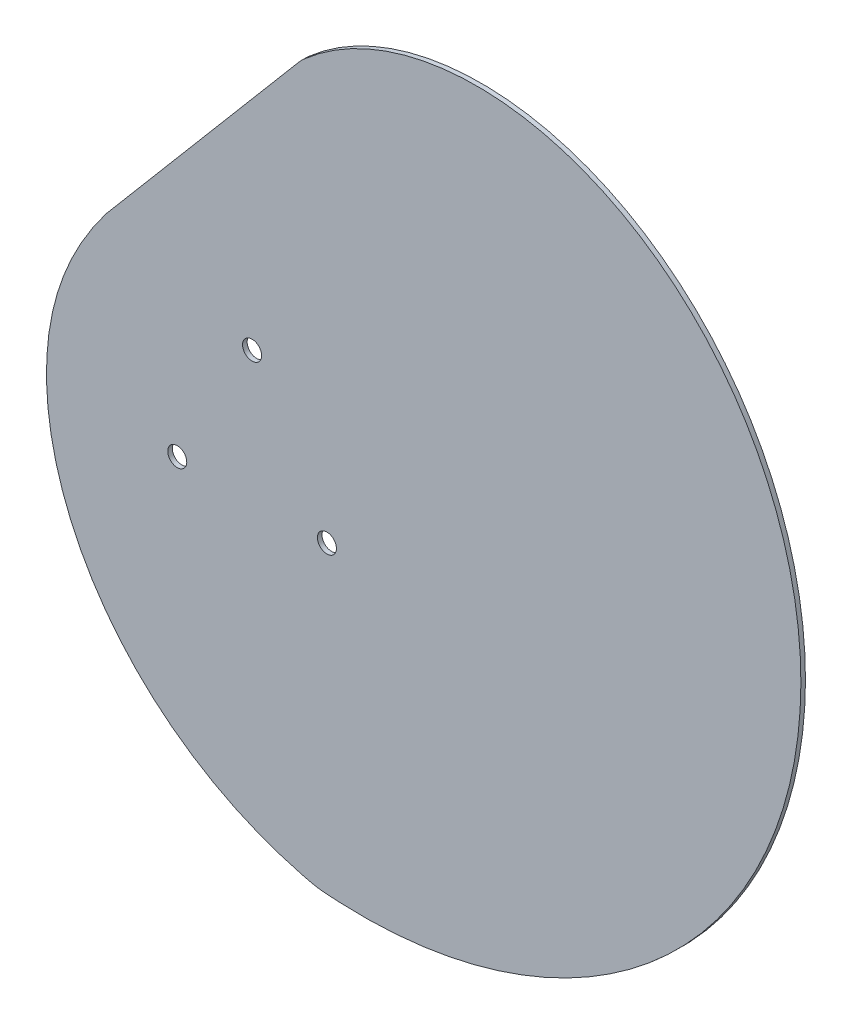
ISO-10303-21;
HEADER;
FILE_DESCRIPTION(('STEP AP214'),'2;1');
FILE_NAME('part.step','',(''),(''),'','','');
FILE_SCHEMA(('AUTOMOTIVE_DESIGN { 1 0 10303 214 1 1 1 1 }'));
ENDSEC;
DATA;
#1=APPLICATION_CONTEXT('core data for automotive mechanical design processes');
#2=APPLICATION_PROTOCOL_DEFINITION('international standard','automotive_design',2000,#1);
#3=PRODUCT_CONTEXT('',#1,'mechanical');
#4=PRODUCT('Part','Part','',(#3));
#5=PRODUCT_RELATED_PRODUCT_CATEGORY('part','',(#4));
#6=PRODUCT_DEFINITION_FORMATION('','',#4);
#7=PRODUCT_DEFINITION_CONTEXT('part definition',#1,'design');
#8=PRODUCT_DEFINITION('design','',#6,#7);
#9=PRODUCT_DEFINITION_SHAPE('','',#8);
#10=(LENGTH_UNIT() NAMED_UNIT(*) SI_UNIT(.MILLI.,.METRE.));
#11=(NAMED_UNIT(*) PLANE_ANGLE_UNIT() SI_UNIT($,.RADIAN.));
#12=(NAMED_UNIT(*) SI_UNIT($,.STERADIAN.) SOLID_ANGLE_UNIT());
#13=UNCERTAINTY_MEASURE_WITH_UNIT(LENGTH_MEASURE(1.E-05),#10,'distance_accuracy_value','');
#14=(GEOMETRIC_REPRESENTATION_CONTEXT(3) GLOBAL_UNCERTAINTY_ASSIGNED_CONTEXT((#13)) GLOBAL_UNIT_ASSIGNED_CONTEXT((#10,
#11,#12)) REPRESENTATION_CONTEXT('',''));
#15=CARTESIAN_POINT('',(0.,0.,0.));
#16=DIRECTION('',(0.,0.,1.));
#17=DIRECTION('',(1.,0.,0.));
#18=AXIS2_PLACEMENT_3D('',#15,#16,#17);
#19=CARTESIAN_POINT('',(-1.26128431869605,-76.3889966640853,-0.396875));
#20=CARTESIAN_POINT('',(-0.976706935574322,-76.433000958118,-0.396875));
#21=CARTESIAN_POINT('',(-0.40570033732491,-76.5002886734785,-0.396875));
#22=CARTESIAN_POINT('',(0.205282970299483,-76.5431286550552,-0.396875));
#23=CARTESIAN_POINT('',(0.635947632892369,-76.5659234882829,-0.396875));
#24=CARTESIAN_POINT('',(0.943803395898629,-76.5837536992732,-0.396875));
#25=CARTESIAN_POINT('',(1.51657766798327,-76.6253526449032,-0.396875));
#26=CARTESIAN_POINT('',(2.39472861708088,-76.6794226518138,-0.396875));
#27=CARTESIAN_POINT('',(3.1808192769605,-76.7137003743502,-0.396875));
#28=CARTESIAN_POINT('',(4.19803699961454,-76.75168724619,-0.396875));
#29=CARTESIAN_POINT('',(6.0521406389918,-76.7942720929503,-0.396875));
#30=CARTESIAN_POINT('',(8.65531896727179,-76.7757899651055,-0.396875));
#31=CARTESIAN_POINT('',(11.7992302850273,-76.631186753929,-0.396875));
#32=CARTESIAN_POINT('',(14.9308116076091,-76.362150817123,-0.396875));
#33=CARTESIAN_POINT('',(19.0927292822368,-75.8376989684194,-0.396875));
#34=CARTESIAN_POINT('',(24.2526003043896,-74.8709042385839,-0.396875));
#35=CARTESIAN_POINT('',(30.3366917936986,-73.2151665179252,-0.396875));
#36=CARTESIAN_POINT('',(38.2496377184228,-70.3553029330726,-0.396875));
#37=CARTESIAN_POINT('',(47.6646576679233,-65.5807106727296,-0.396875));
#38=CARTESIAN_POINT('',(57.8782405742599,-58.0526588499173,-0.396875));
#39=CARTESIAN_POINT('',(69.6472472290832,-45.8604490127679,-0.396875));
#40=CARTESIAN_POINT('',(80.1730162895738,-27.1334514768673,-0.396875));
#41=CARTESIAN_POINT('',(84.2538630410436,-1.50479165459522,-0.396875));
#42=CARTESIAN_POINT('',(79.5599947434369,19.8412067482863,-0.396875));
#43=CARTESIAN_POINT('',(70.8796865135484,34.9401638956233,-0.396875));
#44=CARTESIAN_POINT('',(62.021642873432,44.7053655266334,-0.396875));
#45=CARTESIAN_POINT('',(51.0907411074019,52.2640812116842,-0.396875));
#46=CARTESIAN_POINT('',(38.576471746608,57.0540859282341,-0.396875));
#47=CARTESIAN_POINT('',(25.1004774931715,58.5603822983813,-0.396875));
#48=CARTESIAN_POINT('',(13.7708368946147,56.6943293928139,-0.396875));
#49=CARTESIAN_POINT('',(5.22574400857566,53.179291685644,-0.396875));
#50=CARTESIAN_POINT('',(-0.75748548654271,49.5274645181489,-0.396875));
#51=CARTESIAN_POINT('',(-5.17982564226412,45.6481332259453,-0.396875));
#52=CARTESIAN_POINT('',(-8.21712868273601,42.3111233056651,-0.396875));
#53=CARTESIAN_POINT('',(-10.2837476793927,39.7285564460287,-0.396875));
#54=CARTESIAN_POINT('',(-12.1453981413637,37.1299230221057,-0.396875));
#55=CARTESIAN_POINT('',(-13.803593656072,34.6302202411006,-0.396875));
#56=CARTESIAN_POINT('',(-15.0263666385234,32.7872172676154,-0.396875));
#57=CARTESIAN_POINT('',(-15.757749026262,31.8150435741405,-0.396875));
#58=CARTESIAN_POINT('',(-16.4572837085939,31.0087975471452,-0.396875));
#59=CARTESIAN_POINT('',(-17.3148530430872,30.2124256121384,-0.396875));
#60=CARTESIAN_POINT('',(-18.8320987171928,29.1405411562789,-0.396875));
#61=CARTESIAN_POINT('',(-20.5794335453912,27.9210149954297,-0.396875));
#62=CARTESIAN_POINT('',(-21.8514483213816,26.9528121584477,-0.396875));
#63=CARTESIAN_POINT('',(-22.9229134864311,26.0255763335065,-0.396875));
#64=CARTESIAN_POINT('',(-23.9113330049711,25.0957745743073,-0.396875));
#65=CARTESIAN_POINT('',(-25.0438847891512,23.9057178105531,-0.396875));
#66=CARTESIAN_POINT('',(-26.2444451597005,22.4769501418682,-0.396875));
#67=CARTESIAN_POINT('',(-27.6678771544237,20.6032078316902,-0.396875));
#68=CARTESIAN_POINT('',(-29.1662720153948,18.3817060593167,-0.396875));
#69=CARTESIAN_POINT('',(-30.6820035254275,16.0304898055358,-0.396875));
#70=CARTESIAN_POINT('',(-31.8417450158577,14.3234191557175,-0.396875));
#71=CARTESIAN_POINT('',(-32.7929265221825,13.0258719381619,-0.396875));
#72=CARTESIAN_POINT('',(-33.7609917005133,11.7717771176703,-0.396875));
#73=CARTESIAN_POINT('',(-35.1935179417244,10.0318274989824,-0.396875));
#74=CARTESIAN_POINT('',(-37.0947743542895,7.68858611063458,-0.396875));
#75=CARTESIAN_POINT('',(-39.6505131759334,4.30610185058949,-0.396875));
#76=CARTESIAN_POINT('',(-42.6514237523282,-0.366044153239744,-0.396875));
#77=CARTESIAN_POINT('',(-45.5355557594005,-6.54725137287064,-0.396875));
#78=CARTESIAN_POINT('',(-47.5029702487626,-13.2116577754802,-0.396875));
#79=CARTESIAN_POINT('',(-48.6844974640878,-22.3699096817478,-0.396875));
#80=CARTESIAN_POINT('',(-47.6098868039418,-33.7322087237693,-0.396875));
#81=CARTESIAN_POINT('',(-42.8642408139455,-46.3451326435725,-0.396875));
#82=CARTESIAN_POINT('',(-36.5641298213063,-55.4680273522898,-0.396875));
#83=CARTESIAN_POINT('',(-30.4296575788591,-61.7275262732319,-0.396875));
#84=CARTESIAN_POINT('',(-25.3568115028753,-65.8672301951248,-0.396875));
#85=CARTESIAN_POINT('',(-20.7978951820845,-68.8298585097831,-0.396875));
#86=CARTESIAN_POINT('',(-16.9868888228126,-70.8972783811654,-0.396875));
#87=CARTESIAN_POINT('',(-14.0571261532245,-72.2940624730244,-0.396875));
#88=CARTESIAN_POINT('',(-11.0574897827893,-73.537247470639,-0.396875));
#89=CARTESIAN_POINT('',(-8.52863978148638,-74.4382486629739,-0.396875));
#90=CARTESIAN_POINT('',(-6.7053553577977,-75.0088395123344,-0.396875));
#91=CARTESIAN_POINT('',(-5.69991861950379,-75.3033007427362,-0.396875));
#92=CARTESIAN_POINT('',(-4.91466346108121,-75.5253296610727,-0.396875));
#93=CARTESIAN_POINT('',(-4.04372816904597,-75.7517503026063,-0.396875));
#94=CARTESIAN_POINT('',(-3.47701846483031,-75.8911528901832,-0.396875));
#95=CARTESIAN_POINT('',(-3.15620305968882,-75.9746877031505,-0.396875));
#96=CARTESIAN_POINT('',(-2.71872815087296,-76.0895979552755,-0.396875));
#97=CARTESIAN_POINT('',(-2.11316463605528,-76.2362629092826,-0.396875));
#98=CARTESIAN_POINT('',(-1.54586170181775,-76.3449923700527,-0.396875));
#99=CARTESIAN_POINT('',(-1.26128431869605,-76.3889966640853,-0.396875));
#100=B_SPLINE_CURVE_WITH_KNOTS('',3,(#19,#20,#21,#22,#23,#24,#25,#26,#27,#28,#29,#30,#31,#32,
#33,#34,#35,#36,#37,#38,#39,#40,#41,#42,#43,#44,#45,#46,#47,#48,#49,#50,#51,#52,#53,#54,#55,#56,
#57,#58,#59,#60,#61,#62,#63,#64,#65,#66,#67,#68,#69,#70,#71,#72,#73,#74,#75,#76,#77,#78,#79,#80,
#81,#82,#83,#84,#85,#86,#87,#88,#89,#90,#91,#92,#93,#94,#95,#96,#97,#98,#99),.UNSPECIFIED.,.T.,
.F.,(4,1,1,1,1,1,1,1,1,1,1,1,1,1,1,1,1,1,1,1,1,1,1,1,1,1,1,1,1,1,1,1,1,1,1,1,1,1,1,1,1,1,1,1,1,
1,1,1,1,1,1,1,1,1,1,1,1,1,1,1,1,1,1,1,1,1,1,1,1,1,1,1,1,1,1,1,1,1,4),(0.,0.0009765625,
0.001953125,0.0029296875,0.00390625,0.005859375,0.0078125,0.009765625,0.01171875,0.015625,
0.0234375,0.03125,0.0390625,0.046875,0.0625,0.078125,0.09375,0.125,0.15625,0.1875,0.25,0.3125,
0.375,0.40625,0.4375,0.46875,0.5,0.53125,0.5625,0.578125,0.59375,0.609375,0.6171875,0.625,
0.6328125,0.640625,0.6484375,0.65234375,0.65625,0.6640625,0.671875,0.67578125,0.6796875,
0.681640625,0.68359375,0.6875,0.69140625,0.6953125,0.703125,0.7109375,0.71875,0.72265625,
0.7265625,0.734375,0.7421875,0.75,0.765625,0.78125,0.796875,0.8125,0.84375,0.875,0.90625,
0.921875,0.9375,0.953125,0.9609375,0.96875,0.9765625,0.984375,0.98828125,0.990234375,0.9921875,
0.994140625,0.99609375,0.9970703125,0.998046875,0.9990234375,1.),.UNSPECIFIED.);
#101=DIRECTION('',(0.,0.,1.));
#102=VECTOR('',#101,1.);
#103=SURFACE_OF_LINEAR_EXTRUSION('',#100,#102);
#104=CARTESIAN_POINT('',(-1.26128431869605,-76.3889966640853,0.396875));
#105=CARTESIAN_POINT('',(-0.976706935574322,-76.433000958118,0.396875));
#106=CARTESIAN_POINT('',(-0.40570033732491,-76.5002886734785,0.396875));
#107=CARTESIAN_POINT('',(0.205282970299483,-76.5431286550552,0.396875));
#108=CARTESIAN_POINT('',(0.635947632892369,-76.5659234882829,0.396875));
#109=CARTESIAN_POINT('',(0.943803395898629,-76.5837536992732,0.396875));
#110=CARTESIAN_POINT('',(1.51657766798327,-76.6253526449032,0.396875));
#111=CARTESIAN_POINT('',(2.39472861708088,-76.6794226518138,0.396875));
#112=CARTESIAN_POINT('',(3.1808192769605,-76.7137003743502,0.396875));
#113=CARTESIAN_POINT('',(4.19803699961454,-76.75168724619,0.396875));
#114=CARTESIAN_POINT('',(6.0521406389918,-76.7942720929503,0.396875));
#115=CARTESIAN_POINT('',(8.65531896727179,-76.7757899651055,0.396875));
#116=CARTESIAN_POINT('',(11.7992302850273,-76.631186753929,0.396875));
#117=CARTESIAN_POINT('',(14.9308116076091,-76.362150817123,0.396875));
#118=CARTESIAN_POINT('',(19.0927292822368,-75.8376989684194,0.396875));
#119=CARTESIAN_POINT('',(24.2526003043896,-74.8709042385839,0.396875));
#120=CARTESIAN_POINT('',(30.3366917936986,-73.2151665179252,0.396875));
#121=CARTESIAN_POINT('',(38.2496377184228,-70.3553029330726,0.396875));
#122=CARTESIAN_POINT('',(47.6646576679233,-65.5807106727296,0.396875));
#123=CARTESIAN_POINT('',(57.8782405742599,-58.0526588499173,0.396875));
#124=CARTESIAN_POINT('',(69.6472472290832,-45.8604490127679,0.396875));
#125=CARTESIAN_POINT('',(80.1730162895738,-27.1334514768673,0.396875));
#126=CARTESIAN_POINT('',(84.2538630410436,-1.50479165459522,0.396875));
#127=CARTESIAN_POINT('',(79.5599947434369,19.8412067482863,0.396875));
#128=CARTESIAN_POINT('',(70.8796865135484,34.9401638956233,0.396875));
#129=CARTESIAN_POINT('',(62.021642873432,44.7053655266334,0.396875));
#130=CARTESIAN_POINT('',(51.0907411074019,52.2640812116842,0.396875));
#131=CARTESIAN_POINT('',(38.576471746608,57.0540859282341,0.396875));
#132=CARTESIAN_POINT('',(25.1004774931715,58.5603822983813,0.396875));
#133=CARTESIAN_POINT('',(13.7708368946147,56.6943293928139,0.396875));
#134=CARTESIAN_POINT('',(5.22574400857566,53.179291685644,0.396875));
#135=CARTESIAN_POINT('',(-0.75748548654271,49.5274645181489,0.396875));
#136=CARTESIAN_POINT('',(-5.17982564226412,45.6481332259453,0.396875));
#137=CARTESIAN_POINT('',(-8.21712868273601,42.3111233056651,0.396875));
#138=CARTESIAN_POINT('',(-10.2837476793927,39.7285564460287,0.396875));
#139=CARTESIAN_POINT('',(-12.1453981413637,37.1299230221057,0.396875));
#140=CARTESIAN_POINT('',(-13.803593656072,34.6302202411006,0.396875));
#141=CARTESIAN_POINT('',(-15.0263666385234,32.7872172676154,0.396875));
#142=CARTESIAN_POINT('',(-15.757749026262,31.8150435741405,0.396875));
#143=CARTESIAN_POINT('',(-16.4572837085939,31.0087975471452,0.396875));
#144=CARTESIAN_POINT('',(-17.3148530430872,30.2124256121384,0.396875));
#145=CARTESIAN_POINT('',(-18.8320987171928,29.1405411562789,0.396875));
#146=CARTESIAN_POINT('',(-20.5794335453912,27.9210149954297,0.396875));
#147=CARTESIAN_POINT('',(-21.8514483213816,26.9528121584477,0.396875));
#148=CARTESIAN_POINT('',(-22.9229134864311,26.0255763335065,0.396875));
#149=CARTESIAN_POINT('',(-23.9113330049711,25.0957745743073,0.396875));
#150=CARTESIAN_POINT('',(-25.0438847891512,23.9057178105531,0.396875));
#151=CARTESIAN_POINT('',(-26.2444451597005,22.4769501418682,0.396875));
#152=CARTESIAN_POINT('',(-27.6678771544237,20.6032078316902,0.396875));
#153=CARTESIAN_POINT('',(-29.1662720153948,18.3817060593167,0.396875));
#154=CARTESIAN_POINT('',(-30.6820035254275,16.0304898055358,0.396875));
#155=CARTESIAN_POINT('',(-31.8417450158577,14.3234191557175,0.396875));
#156=CARTESIAN_POINT('',(-32.7929265221825,13.0258719381619,0.396875));
#157=CARTESIAN_POINT('',(-33.7609917005133,11.7717771176703,0.396875));
#158=CARTESIAN_POINT('',(-35.1935179417244,10.0318274989824,0.396875));
#159=CARTESIAN_POINT('',(-37.0947743542895,7.68858611063458,0.396875));
#160=CARTESIAN_POINT('',(-39.6505131759334,4.30610185058949,0.396875));
#161=CARTESIAN_POINT('',(-42.6514237523282,-0.366044153239744,0.396875));
#162=CARTESIAN_POINT('',(-45.5355557594005,-6.54725137287064,0.396875));
#163=CARTESIAN_POINT('',(-47.5029702487626,-13.2116577754802,0.396875));
#164=CARTESIAN_POINT('',(-48.6844974640878,-22.3699096817478,0.396875));
#165=CARTESIAN_POINT('',(-47.6098868039418,-33.7322087237693,0.396875));
#166=CARTESIAN_POINT('',(-42.8642408139455,-46.3451326435725,0.396875));
#167=CARTESIAN_POINT('',(-36.5641298213063,-55.4680273522898,0.396875));
#168=CARTESIAN_POINT('',(-30.4296575788591,-61.7275262732319,0.396875));
#169=CARTESIAN_POINT('',(-25.3568115028753,-65.8672301951248,0.396875));
#170=CARTESIAN_POINT('',(-20.7978951820845,-68.8298585097831,0.396875));
#171=CARTESIAN_POINT('',(-16.9868888228126,-70.8972783811654,0.396875));
#172=CARTESIAN_POINT('',(-14.0571261532245,-72.2940624730244,0.396875));
#173=CARTESIAN_POINT('',(-11.0574897827893,-73.537247470639,0.396875));
#174=CARTESIAN_POINT('',(-8.52863978148638,-74.4382486629739,0.396875));
#175=CARTESIAN_POINT('',(-6.7053553577977,-75.0088395123344,0.396875));
#176=CARTESIAN_POINT('',(-5.69991861950379,-75.3033007427362,0.396875));
#177=CARTESIAN_POINT('',(-4.91466346108121,-75.5253296610727,0.396875));
#178=CARTESIAN_POINT('',(-4.04372816904597,-75.7517503026063,0.396875));
#179=CARTESIAN_POINT('',(-3.47701846483031,-75.8911528901832,0.396875));
#180=CARTESIAN_POINT('',(-3.15620305968882,-75.9746877031505,0.396875));
#181=CARTESIAN_POINT('',(-2.71872815087296,-76.0895979552755,0.396875));
#182=CARTESIAN_POINT('',(-2.11316463605528,-76.2362629092826,0.396875));
#183=CARTESIAN_POINT('',(-1.54586170181775,-76.3449923700527,0.396875));
#184=CARTESIAN_POINT('',(-1.26128431869605,-76.3889966640853,0.396875));
#185=B_SPLINE_CURVE_WITH_KNOTS('',3,(#104,#105,#106,#107,#108,#109,#110,#111,#112,#113,#114,
#115,#116,#117,#118,#119,#120,#121,#122,#123,#124,#125,#126,#127,#128,#129,#130,#131,#132,#133,
#134,#135,#136,#137,#138,#139,#140,#141,#142,#143,#144,#145,#146,#147,#148,#149,#150,#151,#152,
#153,#154,#155,#156,#157,#158,#159,#160,#161,#162,#163,#164,#165,#166,#167,#168,#169,#170,#171,
#172,#173,#174,#175,#176,#177,#178,#179,#180,#181,#182,#183,#184),.UNSPECIFIED.,.T.,.F.,(4,1,1,
1,1,1,1,1,1,1,1,1,1,1,1,1,1,1,1,1,1,1,1,1,1,1,1,1,1,1,1,1,1,1,1,1,1,1,1,1,1,1,1,1,1,1,1,1,1,1,1,
1,1,1,1,1,1,1,1,1,1,1,1,1,1,1,1,1,1,1,1,1,1,1,1,1,1,1,4),(0.,0.0009765625,0.001953125,
0.0029296875,0.00390625,0.005859375,0.0078125,0.009765625,0.01171875,0.015625,0.0234375,0.03125,
0.0390625,0.046875,0.0625,0.078125,0.09375,0.125,0.15625,0.1875,0.25,0.3125,0.375,0.40625,
0.4375,0.46875,0.5,0.53125,0.5625,0.578125,0.59375,0.609375,0.6171875,0.625,0.6328125,0.640625,
0.6484375,0.65234375,0.65625,0.6640625,0.671875,0.67578125,0.6796875,0.681640625,0.68359375,
0.6875,0.69140625,0.6953125,0.703125,0.7109375,0.71875,0.72265625,0.7265625,0.734375,0.7421875,
0.75,0.765625,0.78125,0.796875,0.8125,0.84375,0.875,0.90625,0.921875,0.9375,0.953125,0.9609375,
0.96875,0.9765625,0.984375,0.98828125,0.990234375,0.9921875,0.994140625,0.99609375,0.9970703125,
0.998046875,0.9990234375,1.),.UNSPECIFIED.);
#186=CARTESIAN_POINT('',(-37.9799857120954,6.50792390325195,0.396875));
#187=VERTEX_POINT('',#186);
#188=CARTESIAN_POINT('',(-3.53695857470606,47.0282576025844,0.396875));
#189=VERTEX_POINT('',#188);
#190=EDGE_CURVE('E84',#187,#189,#185,.T.);
#191=ORIENTED_EDGE('',*,*,#190,.F.);
#192=DIRECTION('',(0.,0.,-1.));
#193=VECTOR('',#192,1.);
#194=CARTESIAN_POINT('',(-37.9799857120954,6.50792390325195,0.396875));
#195=LINE('',#194,#193);
#196=CARTESIAN_POINT('',(-37.9799857120954,6.50792390325195,-0.396875));
#197=VERTEX_POINT('',#196);
#198=EDGE_CURVE('E71',#187,#197,#195,.T.);
#199=ORIENTED_EDGE('',*,*,#198,.T.);
#200=CARTESIAN_POINT('',(-3.53695857470606,47.0282576025844,-0.396875));
#201=VERTEX_POINT('',#200);
#202=EDGE_CURVE('E77',#197,#201,#100,.T.);
#203=ORIENTED_EDGE('',*,*,#202,.T.);
#204=DIRECTION('',(0.,0.,1.));
#205=VECTOR('',#204,1.);
#206=CARTESIAN_POINT('',(-3.53695857470606,47.0282576025844,0.396875));
#207=LINE('',#206,#205);
#208=EDGE_CURVE('E147',#189,#201,#207,.F.);
#209=ORIENTED_EDGE('',*,*,#208,.F.);
#210=EDGE_LOOP('',(#191,#199,#203,#209));
#211=FACE_BOUND('',#210,.T.);
#212=ADVANCED_FACE('F37',(#211),#103,.T.);
#213=CARTESIAN_POINT('',(0.,0.,-0.396875));
#214=DIRECTION('',(0.,0.,-1.));
#215=DIRECTION('',(1.,0.,0.));
#216=AXIS2_PLACEMENT_3D('',#213,#214,#215);
#217=PLANE('',#216);
#218=CARTESIAN_POINT('',(-12.5939001772955,-1.27258597502269,-0.396875000000001));
#219=DIRECTION('',(0.,0.,1.));
#220=DIRECTION('',(1.,0.,0.));
#221=AXIS2_PLACEMENT_3D('',#218,#219,#220);
#222=CIRCLE('',#221,1.64999999999999);
#223=CARTESIAN_POINT('',(-10.9439001772955,-1.27258597502269,-0.396875000000001));
#224=VERTEX_POINT('',#223);
#225=EDGE_CURVE('E130',#224,#224,#222,.T.);
#226=ORIENTED_EDGE('',*,*,#225,.T.);
#227=EDGE_LOOP('',(#226));
#228=FACE_BOUND('',#227,.T.);
#229=CARTESIAN_POINT('',(0.396480879471766,-23.7725859750223,-0.396875000000001));
#230=DIRECTION('',(0.,0.,1.));
#231=DIRECTION('',(1.,0.,0.));
#232=AXIS2_PLACEMENT_3D('',#229,#230,#231);
#233=CIRCLE('',#232,1.64999999999999);
#234=CARTESIAN_POINT('',(2.04648087947175,-23.7725859750223,-0.396875000000001));
#235=VERTEX_POINT('',#234);
#236=EDGE_CURVE('E132',#235,#235,#233,.T.);
#237=ORIENTED_EDGE('',*,*,#236,.T.);
#238=EDGE_LOOP('',(#237));
#239=FACE_BOUND('',#238,.T.);
#240=CARTESIAN_POINT('',(-25.5842812340614,-23.7725859750231,-0.396875000000001));
#241=DIRECTION('',(0.,0.,1.));
#242=DIRECTION('',(1.,0.,0.));
#243=AXIS2_PLACEMENT_3D('',#240,#241,#242);
#244=CIRCLE('',#243,1.64999999999999);
#245=CARTESIAN_POINT('',(-23.9342812340614,-23.7725859750231,-0.396875000000001));
#246=VERTEX_POINT('',#245);
#247=EDGE_CURVE('E140',#246,#246,#244,.T.);
#248=ORIENTED_EDGE('',*,*,#247,.T.);
#249=EDGE_LOOP('',(#248));
#250=FACE_BOUND('',#249,.T.);
#251=ORIENTED_EDGE('',*,*,#202,.F.);
#252=DIRECTION('',(0.64611477291147,0.763240263760737,0.));
#253=VECTOR('',#252,1.);
#254=CARTESIAN_POINT('',(-4.11931026186588,46.506747556973,-0.396875));
#255=LINE('',#254,#253);
#256=CARTESIAN_POINT('',(-4.56394467477297,45.9815113283459,-0.396875));
#257=VERTEX_POINT('',#256);
#258=EDGE_CURVE('E67',#197,#257,#255,.T.);
#259=ORIENTED_EDGE('',*,*,#258,.T.);
#260=CARTESIAN_POINT('',(3.06845796283441,39.5203635992312,-0.396875));
#261=DIRECTION('',(0.,0.,1.));
#262=DIRECTION('',(1.,0.,0.));
#263=AXIS2_PLACEMENT_3D('',#260,#261,#262);
#264=CIRCLE('',#263,10.);
#265=EDGE_CURVE('E79',#201,#257,#264,.T.);
#266=ORIENTED_EDGE('',*,*,#265,.F.);
#267=EDGE_LOOP('',(#251,#259,#266));
#268=FACE_BOUND('',#267,.T.);
#269=ADVANCED_FACE('F78',(#228,#239,#250,#268),#217,.T.);
#270=CARTESIAN_POINT('',(0.,0.,0.396875));
#271=DIRECTION('',(0.,0.,-1.));
#272=DIRECTION('',(1.,0.,0.));
#273=AXIS2_PLACEMENT_3D('',#270,#271,#272);
#274=PLANE('',#273);
#275=CARTESIAN_POINT('',(-12.5939001772955,-1.27258597502269,0.396875));
#276=DIRECTION('',(0.,0.,1.));
#277=DIRECTION('',(1.,0.,0.));
#278=AXIS2_PLACEMENT_3D('',#275,#276,#277);
#279=CIRCLE('',#278,1.65);
#280=CARTESIAN_POINT('',(-10.9439001772955,-1.27258597502269,0.396875));
#281=VERTEX_POINT('',#280);
#282=EDGE_CURVE('E127',#281,#281,#279,.T.);
#283=ORIENTED_EDGE('',*,*,#282,.F.);
#284=EDGE_LOOP('',(#283));
#285=FACE_BOUND('',#284,.T.);
#286=CARTESIAN_POINT('',(0.396480879471766,-23.7725859750223,0.396875));
#287=DIRECTION('',(0.,0.,1.));
#288=DIRECTION('',(1.,0.,0.));
#289=AXIS2_PLACEMENT_3D('',#286,#287,#288);
#290=CIRCLE('',#289,1.65);
#291=CARTESIAN_POINT('',(2.04648087947176,-23.7725859750223,0.396875));
#292=VERTEX_POINT('',#291);
#293=EDGE_CURVE('E137',#292,#292,#290,.T.);
#294=ORIENTED_EDGE('',*,*,#293,.F.);
#295=EDGE_LOOP('',(#294));
#296=FACE_BOUND('',#295,.T.);
#297=CARTESIAN_POINT('',(-25.5842812340614,-23.7725859750231,0.396875));
#298=DIRECTION('',(0.,0.,1.));
#299=DIRECTION('',(1.,0.,0.));
#300=AXIS2_PLACEMENT_3D('',#297,#298,#299);
#301=CIRCLE('',#300,1.65);
#302=CARTESIAN_POINT('',(-23.9342812340614,-23.7725859750231,0.396875));
#303=VERTEX_POINT('',#302);
#304=EDGE_CURVE('E74',#303,#303,#301,.T.);
#305=ORIENTED_EDGE('',*,*,#304,.F.);
#306=EDGE_LOOP('',(#305));
#307=FACE_BOUND('',#306,.T.);
#308=DIRECTION('',(0.64611477291147,0.763240263760737,0.));
#309=VECTOR('',#308,1.);
#310=CARTESIAN_POINT('',(-25.3340204344462,21.4463068015867,0.396875));
#311=LINE('',#310,#309);
#312=CARTESIAN_POINT('',(-4.56394467477297,45.9815113283459,0.396875));
#313=VERTEX_POINT('',#312);
#314=EDGE_CURVE('E83',#187,#313,#311,.T.);
#315=ORIENTED_EDGE('',*,*,#314,.F.);
#316=ORIENTED_EDGE('',*,*,#190,.T.);
#317=CARTESIAN_POINT('',(3.06845796283441,39.5203635992312,0.396875));
#318=DIRECTION('',(0.,0.,1.));
#319=DIRECTION('',(1.,0.,0.));
#320=AXIS2_PLACEMENT_3D('',#317,#318,#319);
#321=CIRCLE('',#320,10.);
#322=EDGE_CURVE('E11',#313,#189,#321,.F.);
#323=ORIENTED_EDGE('',*,*,#322,.F.);
#324=EDGE_LOOP('',(#315,#316,#323));
#325=FACE_BOUND('',#324,.T.);
#326=ADVANCED_FACE('F101',(#285,#296,#307,#325),#274,.F.);
#327=CARTESIAN_POINT('',(-4.11931026186588,46.506747556973,0.396875));
#328=DIRECTION('',(0.763240263760737,-0.64611477291147,0.));
#329=DIRECTION('',(0.64611477291147,0.763240263760737,0.));
#330=AXIS2_PLACEMENT_3D('',#327,#328,#329);
#331=PLANE('',#330);
#332=ORIENTED_EDGE('',*,*,#258,.F.);
#333=ORIENTED_EDGE('',*,*,#198,.F.);
#334=ORIENTED_EDGE('',*,*,#314,.T.);
#335=DIRECTION('',(0.,0.,1.));
#336=VECTOR('',#335,1.);
#337=CARTESIAN_POINT('',(-4.56394467477297,45.9815113283459,0.396875));
#338=LINE('',#337,#336);
#339=EDGE_CURVE('E45',#257,#313,#338,.T.);
#340=ORIENTED_EDGE('',*,*,#339,.F.);
#341=EDGE_LOOP('',(#332,#333,#334,#340));
#342=FACE_BOUND('',#341,.T.);
#343=ADVANCED_FACE('F69',(#342),#331,.F.);
#344=CARTESIAN_POINT('',(-25.5842812340614,-23.7725859750231,-0.396875));
#345=DIRECTION('',(0.,0.,-1.));
#346=DIRECTION('',(1.,0.,0.));
#347=AXIS2_PLACEMENT_3D('',#344,#345,#346);
#348=CYLINDRICAL_SURFACE('',#347,1.64999999999999);
#349=ORIENTED_EDGE('',*,*,#304,.T.);
#350=EDGE_LOOP('',(#349));
#351=FACE_BOUND('',#350,.T.);
#352=ORIENTED_EDGE('',*,*,#247,.F.);
#353=EDGE_LOOP('',(#352));
#354=FACE_BOUND('',#353,.T.);
#355=ADVANCED_FACE('F110',(#351,#354),#348,.F.);
#356=CARTESIAN_POINT('',(0.396480879471766,-23.7725859750223,-0.396875));
#357=DIRECTION('',(0.,0.,-1.));
#358=DIRECTION('',(1.,0.,0.));
#359=AXIS2_PLACEMENT_3D('',#356,#357,#358);
#360=CYLINDRICAL_SURFACE('',#359,1.64999999999999);
#361=ORIENTED_EDGE('',*,*,#293,.T.);
#362=EDGE_LOOP('',(#361));
#363=FACE_BOUND('',#362,.T.);
#364=ORIENTED_EDGE('',*,*,#236,.F.);
#365=EDGE_LOOP('',(#364));
#366=FACE_BOUND('',#365,.T.);
#367=ADVANCED_FACE('F113',(#363,#366),#360,.F.);
#368=CARTESIAN_POINT('',(-12.5939001772955,-1.27258597502269,-0.396875));
#369=DIRECTION('',(0.,0.,-1.));
#370=DIRECTION('',(1.,0.,0.));
#371=AXIS2_PLACEMENT_3D('',#368,#369,#370);
#372=CYLINDRICAL_SURFACE('',#371,1.64999999999999);
#373=ORIENTED_EDGE('',*,*,#282,.T.);
#374=EDGE_LOOP('',(#373));
#375=FACE_BOUND('',#374,.T.);
#376=ORIENTED_EDGE('',*,*,#225,.F.);
#377=EDGE_LOOP('',(#376));
#378=FACE_BOUND('',#377,.T.);
#379=ADVANCED_FACE('F117',(#375,#378),#372,.F.);
#380=CARTESIAN_POINT('',(3.06845796283441,39.5203635992312,0.));
#381=DIRECTION('',(0.,0.,1.));
#382=DIRECTION('',(-1.,0.,0.));
#383=AXIS2_PLACEMENT_3D('',#380,#381,#382);
#384=CYLINDRICAL_SURFACE('',#383,10.);
#385=ORIENTED_EDGE('',*,*,#322,.T.);
#386=ORIENTED_EDGE('',*,*,#208,.T.);
#387=ORIENTED_EDGE('',*,*,#265,.T.);
#388=ORIENTED_EDGE('',*,*,#339,.T.);
#389=EDGE_LOOP('',(#385,#386,#387,#388));
#390=FACE_BOUND('',#389,.T.);
#391=ADVANCED_FACE('F39',(#390),#384,.T.);
#392=CLOSED_SHELL('',(#212,#269,#326,#343,#355,#367,#379,#391));
#393=MANIFOLD_SOLID_BREP('B2',#392);
#394=ADVANCED_BREP_SHAPE_REPRESENTATION('',(#18,#393),#14);
#395=SHAPE_DEFINITION_REPRESENTATION(#9,#394);
ENDSEC;
END-ISO-10303-21;
